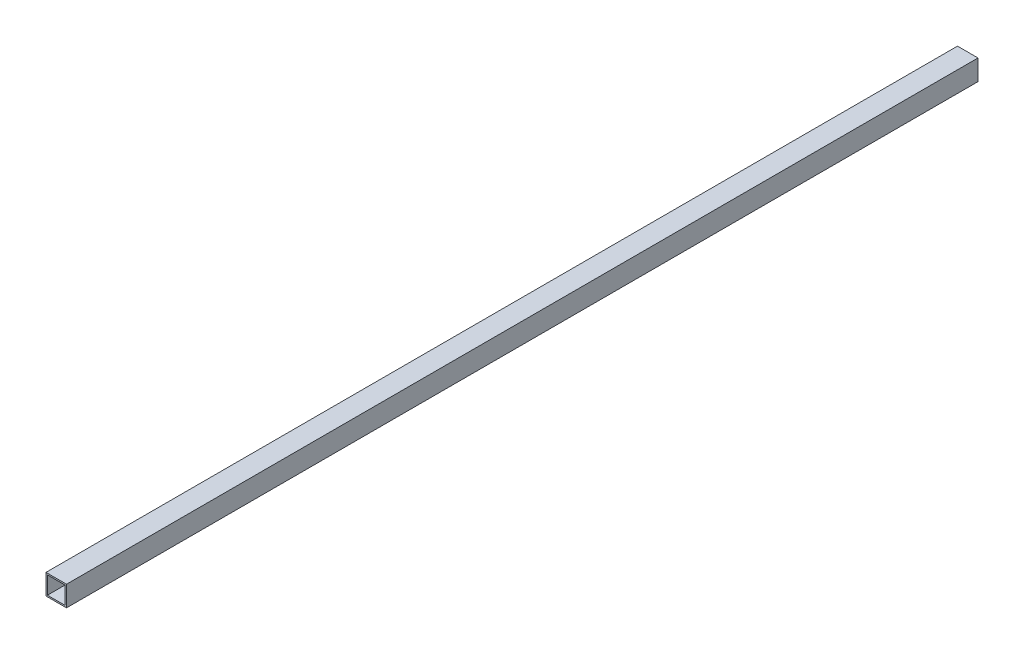
ISO-10303-21;
HEADER;
FILE_DESCRIPTION(('STEP AP214'),'2;1');
FILE_NAME('part.step','',(''),(''),'','','');
FILE_SCHEMA(('AUTOMOTIVE_DESIGN { 1 0 10303 214 1 1 1 1 }'));
ENDSEC;
DATA;
#1=APPLICATION_CONTEXT('core data for automotive mechanical design processes');
#2=APPLICATION_PROTOCOL_DEFINITION('international standard','automotive_design',2000,#1);
#3=PRODUCT_CONTEXT('',#1,'mechanical');
#4=PRODUCT('Part','Part','',(#3));
#5=PRODUCT_RELATED_PRODUCT_CATEGORY('part','',(#4));
#6=PRODUCT_DEFINITION_FORMATION('','',#4);
#7=PRODUCT_DEFINITION_CONTEXT('part definition',#1,'design');
#8=PRODUCT_DEFINITION('design','',#6,#7);
#9=PRODUCT_DEFINITION_SHAPE('','',#8);
#10=(LENGTH_UNIT() NAMED_UNIT(*) SI_UNIT(.MILLI.,.METRE.));
#11=(NAMED_UNIT(*) PLANE_ANGLE_UNIT() SI_UNIT($,.RADIAN.));
#12=(NAMED_UNIT(*) SI_UNIT($,.STERADIAN.) SOLID_ANGLE_UNIT());
#13=UNCERTAINTY_MEASURE_WITH_UNIT(LENGTH_MEASURE(1.E-05),#10,'distance_accuracy_value','');
#14=(GEOMETRIC_REPRESENTATION_CONTEXT(3) GLOBAL_UNCERTAINTY_ASSIGNED_CONTEXT((#13)) GLOBAL_UNIT_ASSIGNED_CONTEXT((#10,
#11,#12)) REPRESENTATION_CONTEXT('',''));
#15=CARTESIAN_POINT('',(0.,0.,0.));
#16=DIRECTION('',(0.,0.,1.));
#17=DIRECTION('',(1.,0.,0.));
#18=AXIS2_PLACEMENT_3D('',#15,#16,#17);
#19=CARTESIAN_POINT('',(0.,0.,1974.85));
#20=DIRECTION('',(0.,0.,-1.));
#21=DIRECTION('',(-1.,0.,0.));
#22=AXIS2_PLACEMENT_3D('',#19,#20,#21);
#23=PLANE('',#22);
#24=DIRECTION('',(0.,1.,0.));
#25=VECTOR('',#24,1.);
#26=CARTESIAN_POINT('',(22.225,-22.225,1974.85));
#27=LINE('',#26,#25);
#28=CARTESIAN_POINT('',(22.225,-22.225,1974.85));
#29=VERTEX_POINT('',#28);
#30=CARTESIAN_POINT('',(22.225,22.225,1974.85));
#31=VERTEX_POINT('',#30);
#32=EDGE_CURVE('E135',#29,#31,#27,.T.);
#33=ORIENTED_EDGE('',*,*,#32,.T.);
#34=DIRECTION('',(-1.,0.,0.));
#35=VECTOR('',#34,1.);
#36=CARTESIAN_POINT('',(-22.225,22.225,1974.85));
#37=LINE('',#36,#35);
#38=CARTESIAN_POINT('',(-22.225,22.225,1974.85));
#39=VERTEX_POINT('',#38);
#40=EDGE_CURVE('E138',#31,#39,#37,.T.);
#41=ORIENTED_EDGE('',*,*,#40,.T.);
#42=DIRECTION('',(0.,-1.,0.));
#43=VECTOR('',#42,1.);
#44=CARTESIAN_POINT('',(-22.225,-22.225,1974.85));
#45=LINE('',#44,#43);
#46=CARTESIAN_POINT('',(-22.225,-22.225,1974.85));
#47=VERTEX_POINT('',#46);
#48=EDGE_CURVE('E141',#39,#47,#45,.T.);
#49=ORIENTED_EDGE('',*,*,#48,.T.);
#50=DIRECTION('',(1.,0.,0.));
#51=VECTOR('',#50,1.);
#52=CARTESIAN_POINT('',(-22.225,-22.225,1974.85));
#53=LINE('',#52,#51);
#54=EDGE_CURVE('E143',#47,#29,#53,.T.);
#55=ORIENTED_EDGE('',*,*,#54,.T.);
#56=EDGE_LOOP('',(#33,#41,#49,#55));
#57=FACE_BOUND('',#56,.T.);
#58=DIRECTION('',(1.,0.,0.));
#59=VECTOR('',#58,1.);
#60=CARTESIAN_POINT('',(-19.05,-19.05,1974.85));
#61=LINE('',#60,#59);
#62=CARTESIAN_POINT('',(-19.05,-19.05,1974.85));
#63=VERTEX_POINT('',#62);
#64=CARTESIAN_POINT('',(19.05,-19.05,1974.85));
#65=VERTEX_POINT('',#64);
#66=EDGE_CURVE('E99',#63,#65,#61,.T.);
#67=ORIENTED_EDGE('',*,*,#66,.F.);
#68=DIRECTION('',(0.,-1.,0.));
#69=VECTOR('',#68,1.);
#70=CARTESIAN_POINT('',(-19.05,-19.05,1974.85));
#71=LINE('',#70,#69);
#72=CARTESIAN_POINT('',(-19.05,19.05,1974.85));
#73=VERTEX_POINT('',#72);
#74=EDGE_CURVE('E121',#73,#63,#71,.T.);
#75=ORIENTED_EDGE('',*,*,#74,.F.);
#76=DIRECTION('',(-1.,0.,0.));
#77=VECTOR('',#76,1.);
#78=CARTESIAN_POINT('',(-19.05,19.05,1974.85));
#79=LINE('',#78,#77);
#80=CARTESIAN_POINT('',(19.05,19.05,1974.85));
#81=VERTEX_POINT('',#80);
#82=EDGE_CURVE('E119',#81,#73,#79,.T.);
#83=ORIENTED_EDGE('',*,*,#82,.F.);
#84=DIRECTION('',(0.,1.,0.));
#85=VECTOR('',#84,1.);
#86=CARTESIAN_POINT('',(19.05,-19.05,1974.85));
#87=LINE('',#86,#85);
#88=EDGE_CURVE('E107',#65,#81,#87,.T.);
#89=ORIENTED_EDGE('',*,*,#88,.F.);
#90=EDGE_LOOP('',(#67,#75,#83,#89));
#91=FACE_BOUND('',#90,.T.);
#92=ADVANCED_FACE('F34',(#57,#91),#23,.F.);
#93=CARTESIAN_POINT('',(0.,0.,0.));
#94=DIRECTION('',(0.,0.,-1.));
#95=DIRECTION('',(-1.,0.,0.));
#96=AXIS2_PLACEMENT_3D('',#93,#94,#95);
#97=PLANE('',#96);
#98=DIRECTION('',(0.,1.,0.));
#99=VECTOR('',#98,1.);
#100=CARTESIAN_POINT('',(22.225,-22.225,0.));
#101=LINE('',#100,#99);
#102=CARTESIAN_POINT('',(22.225,-22.225,0.));
#103=VERTEX_POINT('',#102);
#104=CARTESIAN_POINT('',(22.225,22.225,0.));
#105=VERTEX_POINT('',#104);
#106=EDGE_CURVE('E115',#103,#105,#101,.T.);
#107=ORIENTED_EDGE('',*,*,#106,.F.);
#108=DIRECTION('',(1.,0.,0.));
#109=VECTOR('',#108,1.);
#110=CARTESIAN_POINT('',(-22.225,-22.225,0.));
#111=LINE('',#110,#109);
#112=CARTESIAN_POINT('',(-22.225,-22.225,0.));
#113=VERTEX_POINT('',#112);
#114=EDGE_CURVE('E139',#113,#103,#111,.T.);
#115=ORIENTED_EDGE('',*,*,#114,.F.);
#116=DIRECTION('',(0.,-1.,0.));
#117=VECTOR('',#116,1.);
#118=CARTESIAN_POINT('',(-22.225,-22.225,0.));
#119=LINE('',#118,#117);
#120=CARTESIAN_POINT('',(-22.225,22.225,0.));
#121=VERTEX_POINT('',#120);
#122=EDGE_CURVE('E150',#121,#113,#119,.T.);
#123=ORIENTED_EDGE('',*,*,#122,.F.);
#124=DIRECTION('',(-1.,0.,0.));
#125=VECTOR('',#124,1.);
#126=CARTESIAN_POINT('',(-22.225,22.225,0.));
#127=LINE('',#126,#125);
#128=EDGE_CURVE('E148',#105,#121,#127,.T.);
#129=ORIENTED_EDGE('',*,*,#128,.F.);
#130=EDGE_LOOP('',(#107,#115,#123,#129));
#131=FACE_BOUND('',#130,.T.);
#132=DIRECTION('',(0.,-1.,0.));
#133=VECTOR('',#132,1.);
#134=CARTESIAN_POINT('',(-19.05,-19.05,0.));
#135=LINE('',#134,#133);
#136=CARTESIAN_POINT('',(-19.05,19.05,0.));
#137=VERTEX_POINT('',#136);
#138=CARTESIAN_POINT('',(-19.05,-19.05,0.));
#139=VERTEX_POINT('',#138);
#140=EDGE_CURVE('E108',#137,#139,#135,.T.);
#141=ORIENTED_EDGE('',*,*,#140,.T.);
#142=DIRECTION('',(1.,0.,0.));
#143=VECTOR('',#142,1.);
#144=CARTESIAN_POINT('',(-19.05,-19.05,0.));
#145=LINE('',#144,#143);
#146=CARTESIAN_POINT('',(19.05,-19.05,0.));
#147=VERTEX_POINT('',#146);
#148=EDGE_CURVE('E57',#139,#147,#145,.T.);
#149=ORIENTED_EDGE('',*,*,#148,.T.);
#150=DIRECTION('',(0.,1.,0.));
#151=VECTOR('',#150,1.);
#152=CARTESIAN_POINT('',(19.05,-19.05,0.));
#153=LINE('',#152,#151);
#154=CARTESIAN_POINT('',(19.05,19.05,0.));
#155=VERTEX_POINT('',#154);
#156=EDGE_CURVE('E114',#147,#155,#153,.T.);
#157=ORIENTED_EDGE('',*,*,#156,.T.);
#158=DIRECTION('',(-1.,0.,0.));
#159=VECTOR('',#158,1.);
#160=CARTESIAN_POINT('',(-19.05,19.05,0.));
#161=LINE('',#160,#159);
#162=EDGE_CURVE('E127',#155,#137,#161,.T.);
#163=ORIENTED_EDGE('',*,*,#162,.T.);
#164=EDGE_LOOP('',(#141,#149,#157,#163));
#165=FACE_BOUND('',#164,.T.);
#166=ADVANCED_FACE('F168',(#131,#165),#97,.T.);
#167=CARTESIAN_POINT('',(22.225,-22.225,1974.85));
#168=DIRECTION('',(-1.,0.,0.));
#169=DIRECTION('',(0.,0.,1.));
#170=AXIS2_PLACEMENT_3D('',#167,#168,#169);
#171=PLANE('',#170);
#172=ORIENTED_EDGE('',*,*,#106,.T.);
#173=DIRECTION('',(0.,0.,-1.));
#174=VECTOR('',#173,1.);
#175=CARTESIAN_POINT('',(22.225,22.225,1974.85));
#176=LINE('',#175,#174);
#177=EDGE_CURVE('E11',#31,#105,#176,.T.);
#178=ORIENTED_EDGE('',*,*,#177,.F.);
#179=ORIENTED_EDGE('',*,*,#32,.F.);
#180=DIRECTION('',(0.,0.,-1.));
#181=VECTOR('',#180,1.);
#182=CARTESIAN_POINT('',(22.225,-22.225,1974.85));
#183=LINE('',#182,#181);
#184=EDGE_CURVE('E145',#29,#103,#183,.T.);
#185=ORIENTED_EDGE('',*,*,#184,.T.);
#186=EDGE_LOOP('',(#172,#178,#179,#185));
#187=FACE_BOUND('',#186,.T.);
#188=ADVANCED_FACE('F36',(#187),#171,.F.);
#189=CARTESIAN_POINT('',(-22.225,22.225,1974.85));
#190=DIRECTION('',(0.,-1.,0.));
#191=DIRECTION('',(0.,0.,-1.));
#192=AXIS2_PLACEMENT_3D('',#189,#190,#191);
#193=PLANE('',#192);
#194=ORIENTED_EDGE('',*,*,#128,.T.);
#195=DIRECTION('',(0.,0.,-1.));
#196=VECTOR('',#195,1.);
#197=CARTESIAN_POINT('',(-22.225,22.225,1974.85));
#198=LINE('',#197,#196);
#199=EDGE_CURVE('E42',#39,#121,#198,.T.);
#200=ORIENTED_EDGE('',*,*,#199,.F.);
#201=ORIENTED_EDGE('',*,*,#40,.F.);
#202=ORIENTED_EDGE('',*,*,#177,.T.);
#203=EDGE_LOOP('',(#194,#200,#201,#202));
#204=FACE_BOUND('',#203,.T.);
#205=ADVANCED_FACE('F178',(#204),#193,.F.);
#206=CARTESIAN_POINT('',(-22.225,-22.225,1974.85));
#207=DIRECTION('',(1.,0.,0.));
#208=DIRECTION('',(0.,0.,-1.));
#209=AXIS2_PLACEMENT_3D('',#206,#207,#208);
#210=PLANE('',#209);
#211=ORIENTED_EDGE('',*,*,#122,.T.);
#212=DIRECTION('',(0.,0.,-1.));
#213=VECTOR('',#212,1.);
#214=CARTESIAN_POINT('',(-22.225,-22.225,1974.85));
#215=LINE('',#214,#213);
#216=EDGE_CURVE('E155',#47,#113,#215,.T.);
#217=ORIENTED_EDGE('',*,*,#216,.F.);
#218=ORIENTED_EDGE('',*,*,#48,.F.);
#219=ORIENTED_EDGE('',*,*,#199,.T.);
#220=EDGE_LOOP('',(#211,#217,#218,#219));
#221=FACE_BOUND('',#220,.T.);
#222=ADVANCED_FACE('F162',(#221),#210,.F.);
#223=CARTESIAN_POINT('',(-22.225,-22.225,1974.85));
#224=DIRECTION('',(0.,1.,0.));
#225=DIRECTION('',(0.,0.,1.));
#226=AXIS2_PLACEMENT_3D('',#223,#224,#225);
#227=PLANE('',#226);
#228=ORIENTED_EDGE('',*,*,#114,.T.);
#229=ORIENTED_EDGE('',*,*,#184,.F.);
#230=ORIENTED_EDGE('',*,*,#54,.F.);
#231=ORIENTED_EDGE('',*,*,#216,.T.);
#232=EDGE_LOOP('',(#228,#229,#230,#231));
#233=FACE_BOUND('',#232,.T.);
#234=ADVANCED_FACE('F172',(#233),#227,.F.);
#235=CARTESIAN_POINT('',(-19.05,-19.05,1974.85));
#236=DIRECTION('',(0.,1.,0.));
#237=DIRECTION('',(0.,0.,1.));
#238=AXIS2_PLACEMENT_3D('',#235,#236,#237);
#239=PLANE('',#238);
#240=ORIENTED_EDGE('',*,*,#148,.F.);
#241=DIRECTION('',(0.,0.,-1.));
#242=VECTOR('',#241,1.);
#243=CARTESIAN_POINT('',(-19.05,-19.05,1974.85));
#244=LINE('',#243,#242);
#245=EDGE_CURVE('E103',#63,#139,#244,.T.);
#246=ORIENTED_EDGE('',*,*,#245,.F.);
#247=ORIENTED_EDGE('',*,*,#66,.T.);
#248=DIRECTION('',(0.,0.,-1.));
#249=VECTOR('',#248,1.);
#250=CARTESIAN_POINT('',(19.05,-19.05,1974.85));
#251=LINE('',#250,#249);
#252=EDGE_CURVE('E102',#65,#147,#251,.T.);
#253=ORIENTED_EDGE('',*,*,#252,.T.);
#254=EDGE_LOOP('',(#240,#246,#247,#253));
#255=FACE_BOUND('',#254,.T.);
#256=ADVANCED_FACE('F101',(#255),#239,.T.);
#257=CARTESIAN_POINT('',(19.05,-19.05,1974.85));
#258=DIRECTION('',(-1.,0.,0.));
#259=DIRECTION('',(0.,-1.,0.));
#260=AXIS2_PLACEMENT_3D('',#257,#258,#259);
#261=PLANE('',#260);
#262=ORIENTED_EDGE('',*,*,#156,.F.);
#263=ORIENTED_EDGE('',*,*,#252,.F.);
#264=ORIENTED_EDGE('',*,*,#88,.T.);
#265=DIRECTION('',(0.,0.,-1.));
#266=VECTOR('',#265,1.);
#267=CARTESIAN_POINT('',(19.05,19.05,1974.85));
#268=LINE('',#267,#266);
#269=EDGE_CURVE('E116',#81,#155,#268,.T.);
#270=ORIENTED_EDGE('',*,*,#269,.T.);
#271=EDGE_LOOP('',(#262,#263,#264,#270));
#272=FACE_BOUND('',#271,.T.);
#273=ADVANCED_FACE('F111',(#272),#261,.T.);
#274=CARTESIAN_POINT('',(-19.05,19.05,1974.85));
#275=DIRECTION('',(0.,-1.,0.));
#276=DIRECTION('',(1.,0.,0.));
#277=AXIS2_PLACEMENT_3D('',#274,#275,#276);
#278=PLANE('',#277);
#279=ORIENTED_EDGE('',*,*,#162,.F.);
#280=ORIENTED_EDGE('',*,*,#269,.F.);
#281=ORIENTED_EDGE('',*,*,#82,.T.);
#282=DIRECTION('',(0.,0.,-1.));
#283=VECTOR('',#282,1.);
#284=CARTESIAN_POINT('',(-19.05,19.05,1974.85));
#285=LINE('',#284,#283);
#286=EDGE_CURVE('E49',#73,#137,#285,.T.);
#287=ORIENTED_EDGE('',*,*,#286,.T.);
#288=EDGE_LOOP('',(#279,#280,#281,#287));
#289=FACE_BOUND('',#288,.T.);
#290=ADVANCED_FACE('F201',(#289),#278,.T.);
#291=CARTESIAN_POINT('',(-19.05,-19.05,1974.85));
#292=DIRECTION('',(1.,0.,0.));
#293=DIRECTION('',(0.,0.,-1.));
#294=AXIS2_PLACEMENT_3D('',#291,#292,#293);
#295=PLANE('',#294);
#296=ORIENTED_EDGE('',*,*,#140,.F.);
#297=ORIENTED_EDGE('',*,*,#286,.F.);
#298=ORIENTED_EDGE('',*,*,#74,.T.);
#299=ORIENTED_EDGE('',*,*,#245,.T.);
#300=EDGE_LOOP('',(#296,#297,#298,#299));
#301=FACE_BOUND('',#300,.T.);
#302=ADVANCED_FACE('F205',(#301),#295,.T.);
#303=CLOSED_SHELL('',(#92,#166,#188,#205,#222,#234,#256,#273,#290,#302));
#304=MANIFOLD_SOLID_BREP('B2',#303);
#305=ADVANCED_BREP_SHAPE_REPRESENTATION('',(#18,#304),#14);
#306=SHAPE_DEFINITION_REPRESENTATION(#9,#305);
ENDSEC;
END-ISO-10303-21;
